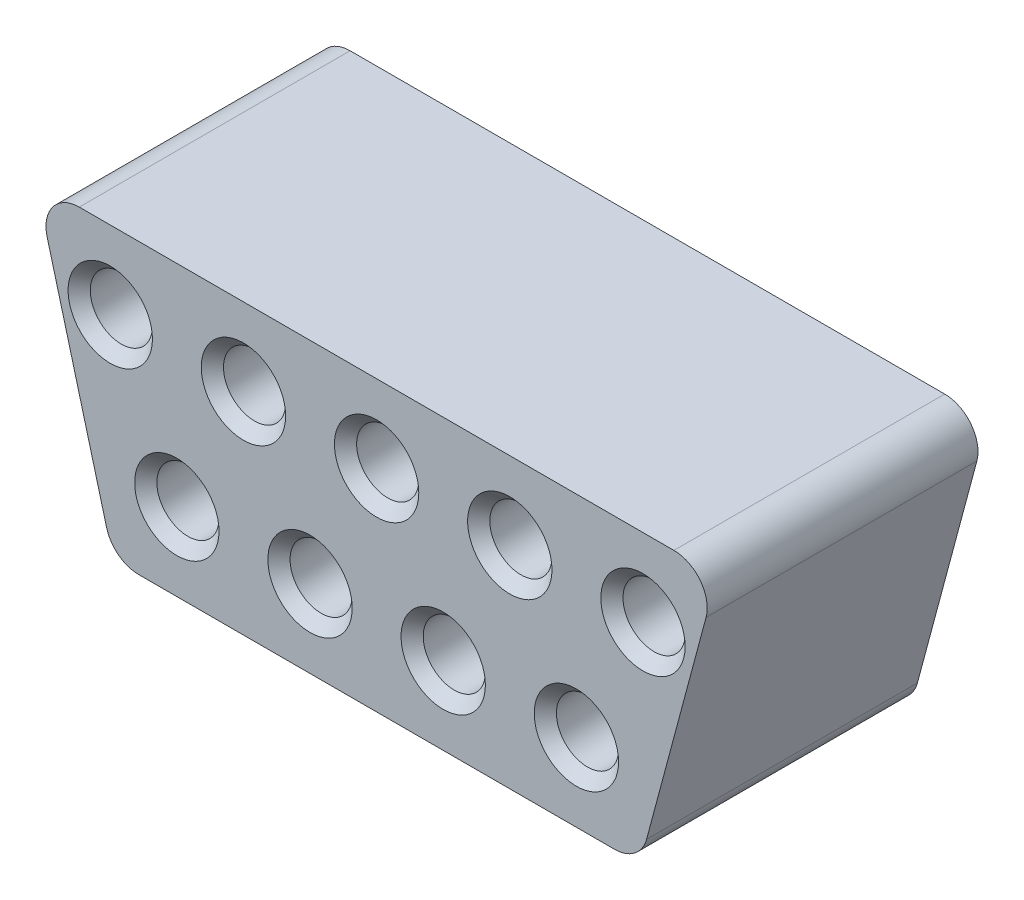
ISO-10303-21;
HEADER;
FILE_DESCRIPTION(('STEP AP214'),'2;1');
FILE_NAME('part.step','',(''),(''),'','','');
FILE_SCHEMA(('AUTOMOTIVE_DESIGN { 1 0 10303 214 1 1 1 1 }'));
ENDSEC;
DATA;
#1=APPLICATION_CONTEXT('core data for automotive mechanical design processes');
#2=APPLICATION_PROTOCOL_DEFINITION('international standard','automotive_design',2000,#1);
#3=PRODUCT_CONTEXT('',#1,'mechanical');
#4=PRODUCT('Part','Part','',(#3));
#5=PRODUCT_RELATED_PRODUCT_CATEGORY('part','',(#4));
#6=PRODUCT_DEFINITION_FORMATION('','',#4);
#7=PRODUCT_DEFINITION_CONTEXT('part definition',#1,'design');
#8=PRODUCT_DEFINITION('design','',#6,#7);
#9=PRODUCT_DEFINITION_SHAPE('','',#8);
#10=(LENGTH_UNIT() NAMED_UNIT(*) SI_UNIT(.MILLI.,.METRE.));
#11=(NAMED_UNIT(*) PLANE_ANGLE_UNIT() SI_UNIT($,.RADIAN.));
#12=(NAMED_UNIT(*) SI_UNIT($,.STERADIAN.) SOLID_ANGLE_UNIT());
#13=UNCERTAINTY_MEASURE_WITH_UNIT(LENGTH_MEASURE(1.E-05),#10,'distance_accuracy_value','');
#14=(GEOMETRIC_REPRESENTATION_CONTEXT(3) GLOBAL_UNCERTAINTY_ASSIGNED_CONTEXT((#13)) GLOBAL_UNIT_ASSIGNED_CONTEXT((#10,
#11,#12)) REPRESENTATION_CONTEXT('',''));
#15=CARTESIAN_POINT('',(0.,0.,0.));
#16=DIRECTION('',(0.,0.,1.));
#17=DIRECTION('',(1.,0.,0.));
#18=AXIS2_PLACEMENT_3D('',#15,#16,#17);
#19=CARTESIAN_POINT('',(-6.34791042089401,-1.70091747090367,6.1));
#20=DIRECTION('',(0.965925826289068,0.258819045102522,0.));
#21=DIRECTION('',(-0.258819045102522,0.965925826289068,0.));
#22=AXIS2_PLACEMENT_3D('',#19,#20,#21);
#23=PLANE('',#22);
#24=DIRECTION('',(0.258819045102522,-0.965925826289068,0.));
#25=VECTOR('',#24,1.);
#26=CARTESIAN_POINT('',(-6.34791042089401,-1.70091747090367,0.));
#27=LINE('',#26,#25);
#28=CARTESIAN_POINT('',(-7.42153009910168,2.3058857161731,0.));
#29=VERTEX_POINT('',#28);
#30=CARTESIAN_POINT('',(-6.08178413694606,-2.69411428382689,0.));
#31=VERTEX_POINT('',#30);
#32=EDGE_CURVE('E132',#29,#31,#27,.T.);
#33=ORIENTED_EDGE('',*,*,#32,.T.);
#34=DIRECTION('',(0.,0.,-1.));
#35=VECTOR('',#34,1.);
#36=CARTESIAN_POINT('',(-6.08178413694606,-2.69411428382689,6.1));
#37=LINE('',#36,#35);
#38=CARTESIAN_POINT('',(-6.08178413694606,-2.69411428382689,6.1));
#39=VERTEX_POINT('',#38);
#40=EDGE_CURVE('E163',#39,#31,#37,.T.);
#41=ORIENTED_EDGE('',*,*,#40,.F.);
#42=DIRECTION('',(0.258819045102522,-0.965925826289068,0.));
#43=VECTOR('',#42,1.);
#44=CARTESIAN_POINT('',(-6.34791042089401,-1.70091747090367,6.1));
#45=LINE('',#44,#43);
#46=CARTESIAN_POINT('',(-7.42153009910168,2.3058857161731,6.1));
#47=VERTEX_POINT('',#46);
#48=EDGE_CURVE('E151',#47,#39,#45,.T.);
#49=ORIENTED_EDGE('',*,*,#48,.F.);
#50=DIRECTION('',(0.,0.,-1.));
#51=VECTOR('',#50,1.);
#52=CARTESIAN_POINT('',(-7.42153009910168,2.3058857161731,6.1));
#53=LINE('',#52,#51);
#54=EDGE_CURVE('E51',#47,#29,#53,.T.);
#55=ORIENTED_EDGE('',*,*,#54,.T.);
#56=EDGE_LOOP('',(#33,#41,#49,#55));
#57=FACE_BOUND('',#56,.T.);
#58=ADVANCED_FACE('F34',(#57),#23,.F.);
#59=CARTESIAN_POINT('',(-5.35733976722926,-2.5,6.1));
#60=DIRECTION('',(0.,0.,-1.));
#61=DIRECTION('',(-1.,0.,0.));
#62=AXIS2_PLACEMENT_3D('',#59,#60,#61);
#63=CYLINDRICAL_SURFACE('',#62,0.75);
#64=CARTESIAN_POINT('',(-5.35733976722926,-2.5,0.));
#65=DIRECTION('',(0.,0.,1.));
#66=DIRECTION('',(1.,0.,0.));
#67=AXIS2_PLACEMENT_3D('',#64,#65,#66);
#68=CIRCLE('',#67,0.75);
#69=CARTESIAN_POINT('',(-5.35733976722925,-3.25,0.));
#70=VERTEX_POINT('',#69);
#71=EDGE_CURVE('E134',#31,#70,#68,.T.);
#72=ORIENTED_EDGE('',*,*,#71,.T.);
#73=DIRECTION('',(0.,0.,-1.));
#74=VECTOR('',#73,1.);
#75=CARTESIAN_POINT('',(-5.35733976722925,-3.25,6.1));
#76=LINE('',#75,#74);
#77=CARTESIAN_POINT('',(-5.35733976722925,-3.25,6.1));
#78=VERTEX_POINT('',#77);
#79=EDGE_CURVE('E160',#78,#70,#76,.T.);
#80=ORIENTED_EDGE('',*,*,#79,.F.);
#81=CARTESIAN_POINT('',(-5.35733976722926,-2.5,6.1));
#82=DIRECTION('',(0.,0.,1.));
#83=DIRECTION('',(1.,0.,0.));
#84=AXIS2_PLACEMENT_3D('',#81,#82,#83);
#85=CIRCLE('',#84,0.75);
#86=EDGE_CURVE('E90',#39,#78,#85,.T.);
#87=ORIENTED_EDGE('',*,*,#86,.F.);
#88=ORIENTED_EDGE('',*,*,#40,.T.);
#89=EDGE_LOOP('',(#72,#80,#87,#88));
#90=FACE_BOUND('',#89,.T.);
#91=ADVANCED_FACE('F232',(#90),#63,.T.);
#92=CARTESIAN_POINT('',(0.,-3.25,6.1));
#93=DIRECTION('',(0.,1.,0.));
#94=DIRECTION('',(0.,0.,1.));
#95=AXIS2_PLACEMENT_3D('',#92,#93,#94);
#96=PLANE('',#95);
#97=DIRECTION('',(1.,0.,0.));
#98=VECTOR('',#97,1.);
#99=CARTESIAN_POINT('',(0.,-3.25,0.));
#100=LINE('',#99,#98);
#101=CARTESIAN_POINT('',(5.35733976722925,-3.25,0.));
#102=VERTEX_POINT('',#101);
#103=EDGE_CURVE('E137',#70,#102,#100,.T.);
#104=ORIENTED_EDGE('',*,*,#103,.T.);
#105=DIRECTION('',(0.,0.,-1.));
#106=VECTOR('',#105,1.);
#107=CARTESIAN_POINT('',(5.35733976722925,-3.25,6.1));
#108=LINE('',#107,#106);
#109=CARTESIAN_POINT('',(5.35733976722925,-3.25,6.1));
#110=VERTEX_POINT('',#109);
#111=EDGE_CURVE('E157',#110,#102,#108,.T.);
#112=ORIENTED_EDGE('',*,*,#111,.F.);
#113=DIRECTION('',(1.,0.,0.));
#114=VECTOR('',#113,1.);
#115=CARTESIAN_POINT('',(0.,-3.25,6.1));
#116=LINE('',#115,#114);
#117=EDGE_CURVE('E297',#78,#110,#116,.T.);
#118=ORIENTED_EDGE('',*,*,#117,.F.);
#119=ORIENTED_EDGE('',*,*,#79,.T.);
#120=EDGE_LOOP('',(#104,#112,#118,#119));
#121=FACE_BOUND('',#120,.T.);
#122=ADVANCED_FACE('F237',(#121),#96,.F.);
#123=CARTESIAN_POINT('',(5.35733976722926,-2.5,6.1));
#124=DIRECTION('',(0.,0.,-1.));
#125=DIRECTION('',(-1.,0.,0.));
#126=AXIS2_PLACEMENT_3D('',#123,#124,#125);
#127=CYLINDRICAL_SURFACE('',#126,0.75);
#128=CARTESIAN_POINT('',(5.35733976722926,-2.5,0.));
#129=DIRECTION('',(0.,0.,1.));
#130=DIRECTION('',(1.,0.,0.));
#131=AXIS2_PLACEMENT_3D('',#128,#129,#130);
#132=CIRCLE('',#131,0.75);
#133=CARTESIAN_POINT('',(6.08178413694606,-2.69411428382689,0.));
#134=VERTEX_POINT('',#133);
#135=EDGE_CURVE('E139',#102,#134,#132,.T.);
#136=ORIENTED_EDGE('',*,*,#135,.T.);
#137=DIRECTION('',(0.,0.,-1.));
#138=VECTOR('',#137,1.);
#139=CARTESIAN_POINT('',(6.08178413694606,-2.69411428382689,6.1));
#140=LINE('',#139,#138);
#141=CARTESIAN_POINT('',(6.08178413694606,-2.69411428382689,6.1));
#142=VERTEX_POINT('',#141);
#143=EDGE_CURVE('E155',#142,#134,#140,.T.);
#144=ORIENTED_EDGE('',*,*,#143,.F.);
#145=CARTESIAN_POINT('',(5.35733976722926,-2.5,6.1));
#146=DIRECTION('',(0.,0.,1.));
#147=DIRECTION('',(1.,0.,0.));
#148=AXIS2_PLACEMENT_3D('',#145,#146,#147);
#149=CIRCLE('',#148,0.75);
#150=EDGE_CURVE('E299',#110,#142,#149,.T.);
#151=ORIENTED_EDGE('',*,*,#150,.F.);
#152=ORIENTED_EDGE('',*,*,#111,.T.);
#153=EDGE_LOOP('',(#136,#144,#151,#152));
#154=FACE_BOUND('',#153,.T.);
#155=ADVANCED_FACE('F323',(#154),#127,.T.);
#156=CARTESIAN_POINT('',(6.34791042089401,-1.70091747090367,6.1));
#157=DIRECTION('',(0.965925826289068,-0.258819045102522,0.));
#158=DIRECTION('',(0.258819045102522,0.965925826289068,0.));
#159=AXIS2_PLACEMENT_3D('',#156,#157,#158);
#160=PLANE('',#159);
#161=DIRECTION('',(-0.258819045102522,-0.965925826289068,0.));
#162=VECTOR('',#161,1.);
#163=CARTESIAN_POINT('',(6.34791042089401,-1.70091747090367,0.));
#164=LINE('',#163,#162);
#165=CARTESIAN_POINT('',(7.42153009910168,2.3058857161731,0.));
#166=VERTEX_POINT('',#165);
#167=EDGE_CURVE('E142',#166,#134,#164,.T.);
#168=ORIENTED_EDGE('',*,*,#167,.F.);
#169=DIRECTION('',(0.,0.,-1.));
#170=VECTOR('',#169,1.);
#171=CARTESIAN_POINT('',(7.42153009910168,2.3058857161731,6.1));
#172=LINE('',#171,#170);
#173=CARTESIAN_POINT('',(7.42153009910168,2.3058857161731,6.1));
#174=VERTEX_POINT('',#173);
#175=EDGE_CURVE('E124',#174,#166,#172,.T.);
#176=ORIENTED_EDGE('',*,*,#175,.F.);
#177=DIRECTION('',(-0.258819045102522,-0.965925826289068,0.));
#178=VECTOR('',#177,1.);
#179=CARTESIAN_POINT('',(6.34791042089401,-1.70091747090367,6.1));
#180=LINE('',#179,#178);
#181=EDGE_CURVE('E114',#174,#142,#180,.T.);
#182=ORIENTED_EDGE('',*,*,#181,.T.);
#183=ORIENTED_EDGE('',*,*,#143,.T.);
#184=EDGE_LOOP('',(#168,#176,#182,#183));
#185=FACE_BOUND('',#184,.T.);
#186=ADVANCED_FACE('F302',(#185),#160,.T.);
#187=CARTESIAN_POINT('',(6.69708572938488,2.5,6.1));
#188=DIRECTION('',(0.,0.,-1.));
#189=DIRECTION('',(-1.,0.,0.));
#190=AXIS2_PLACEMENT_3D('',#187,#188,#189);
#191=CYLINDRICAL_SURFACE('',#190,0.75);
#192=CARTESIAN_POINT('',(6.69708572938488,2.5,0.));
#193=DIRECTION('',(0.,0.,1.));
#194=DIRECTION('',(1.,0.,0.));
#195=AXIS2_PLACEMENT_3D('',#192,#193,#194);
#196=CIRCLE('',#195,0.75);
#197=CARTESIAN_POINT('',(6.69708572938487,3.25,0.));
#198=VERTEX_POINT('',#197);
#199=EDGE_CURVE('E121',#166,#198,#196,.T.);
#200=ORIENTED_EDGE('',*,*,#199,.T.);
#201=DIRECTION('',(0.,0.,-1.));
#202=VECTOR('',#201,1.);
#203=CARTESIAN_POINT('',(6.69708572938487,3.25,6.1));
#204=LINE('',#203,#202);
#205=CARTESIAN_POINT('',(6.69708572938487,3.25,6.1));
#206=VERTEX_POINT('',#205);
#207=EDGE_CURVE('E118',#206,#198,#204,.T.);
#208=ORIENTED_EDGE('',*,*,#207,.F.);
#209=CARTESIAN_POINT('',(6.69708572938488,2.5,6.1));
#210=DIRECTION('',(0.,0.,1.));
#211=DIRECTION('',(1.,0.,0.));
#212=AXIS2_PLACEMENT_3D('',#209,#210,#211);
#213=CIRCLE('',#212,0.75);
#214=EDGE_CURVE('E107',#174,#206,#213,.T.);
#215=ORIENTED_EDGE('',*,*,#214,.F.);
#216=ORIENTED_EDGE('',*,*,#175,.T.);
#217=EDGE_LOOP('',(#200,#208,#215,#216));
#218=FACE_BOUND('',#217,.T.);
#219=ADVANCED_FACE('F119',(#218),#191,.T.);
#220=CARTESIAN_POINT('',(0.,3.25,6.1));
#221=DIRECTION('',(0.,1.,0.));
#222=DIRECTION('',(0.,0.,1.));
#223=AXIS2_PLACEMENT_3D('',#220,#221,#222);
#224=PLANE('',#223);
#225=DIRECTION('',(1.,0.,0.));
#226=VECTOR('',#225,1.);
#227=CARTESIAN_POINT('',(0.,3.25,0.));
#228=LINE('',#227,#226);
#229=CARTESIAN_POINT('',(-6.69708572938487,3.25,0.));
#230=VERTEX_POINT('',#229);
#231=EDGE_CURVE('E146',#230,#198,#228,.T.);
#232=ORIENTED_EDGE('',*,*,#231,.F.);
#233=DIRECTION('',(0.,0.,-1.));
#234=VECTOR('',#233,1.);
#235=CARTESIAN_POINT('',(-6.69708572938487,3.25,6.1));
#236=LINE('',#235,#234);
#237=CARTESIAN_POINT('',(-6.69708572938487,3.25,6.1));
#238=VERTEX_POINT('',#237);
#239=EDGE_CURVE('E77',#238,#230,#236,.T.);
#240=ORIENTED_EDGE('',*,*,#239,.F.);
#241=DIRECTION('',(1.,0.,0.));
#242=VECTOR('',#241,1.);
#243=CARTESIAN_POINT('',(0.,3.25,6.1));
#244=LINE('',#243,#242);
#245=EDGE_CURVE('E112',#238,#206,#244,.T.);
#246=ORIENTED_EDGE('',*,*,#245,.T.);
#247=ORIENTED_EDGE('',*,*,#207,.T.);
#248=EDGE_LOOP('',(#232,#240,#246,#247));
#249=FACE_BOUND('',#248,.T.);
#250=ADVANCED_FACE('F126',(#249),#224,.T.);
#251=CARTESIAN_POINT('',(-6.69708572938488,2.5,6.1));
#252=DIRECTION('',(0.,0.,-1.));
#253=DIRECTION('',(-1.,0.,0.));
#254=AXIS2_PLACEMENT_3D('',#251,#252,#253);
#255=CYLINDRICAL_SURFACE('',#254,0.75);
#256=CARTESIAN_POINT('',(-6.69708572938488,2.5,0.));
#257=DIRECTION('',(0.,0.,1.));
#258=DIRECTION('',(1.,0.,0.));
#259=AXIS2_PLACEMENT_3D('',#256,#257,#258);
#260=CIRCLE('',#259,0.75);
#261=EDGE_CURVE('E148',#29,#230,#260,.F.);
#262=ORIENTED_EDGE('',*,*,#261,.F.);
#263=ORIENTED_EDGE('',*,*,#54,.F.);
#264=CARTESIAN_POINT('',(-6.69708572938488,2.5,6.1));
#265=DIRECTION('',(0.,0.,1.));
#266=DIRECTION('',(1.,0.,0.));
#267=AXIS2_PLACEMENT_3D('',#264,#265,#266);
#268=CIRCLE('',#267,0.75);
#269=EDGE_CURVE('E127',#47,#238,#268,.F.);
#270=ORIENTED_EDGE('',*,*,#269,.T.);
#271=ORIENTED_EDGE('',*,*,#239,.T.);
#272=EDGE_LOOP('',(#262,#263,#270,#271));
#273=FACE_BOUND('',#272,.T.);
#274=ADVANCED_FACE('F307',(#273),#255,.T.);
#275=CARTESIAN_POINT('',(0.,0.,6.1));
#276=DIRECTION('',(0.,0.,1.));
#277=DIRECTION('',(1.,0.,0.));
#278=AXIS2_PLACEMENT_3D('',#275,#276,#277);
#279=PLANE('',#278);
#280=CARTESIAN_POINT('',(-4.49949692208357,-1.5,6.1));
#281=DIRECTION('',(0.,0.,1.));
#282=DIRECTION('',(1.,0.,0.));
#283=AXIS2_PLACEMENT_3D('',#280,#281,#282);
#284=CIRCLE('',#283,0.950000000000005);
#285=CARTESIAN_POINT('',(-3.54949692208357,-1.5,6.1));
#286=VERTEX_POINT('',#285);
#287=EDGE_CURVE('E192',#286,#286,#284,.F.);
#288=ORIENTED_EDGE('',*,*,#287,.T.);
#289=EDGE_LOOP('',(#288));
#290=FACE_BOUND('',#289,.T.);
#291=CARTESIAN_POINT('',(-1.49949692208357,-1.5,6.1));
#292=DIRECTION('',(0.,0.,1.));
#293=DIRECTION('',(1.,0.,0.));
#294=AXIS2_PLACEMENT_3D('',#291,#292,#293);
#295=CIRCLE('',#294,0.950000000000005);
#296=CARTESIAN_POINT('',(-0.549496922083567,-1.5,6.1));
#297=VERTEX_POINT('',#296);
#298=EDGE_CURVE('E189',#297,#297,#295,.F.);
#299=ORIENTED_EDGE('',*,*,#298,.T.);
#300=EDGE_LOOP('',(#299));
#301=FACE_BOUND('',#300,.T.);
#302=CARTESIAN_POINT('',(1.50050307791643,-1.5,6.1));
#303=DIRECTION('',(0.,0.,1.));
#304=DIRECTION('',(1.,0.,0.));
#305=AXIS2_PLACEMENT_3D('',#302,#303,#304);
#306=CIRCLE('',#305,0.950000000000005);
#307=CARTESIAN_POINT('',(2.45050307791643,-1.5,6.1));
#308=VERTEX_POINT('',#307);
#309=EDGE_CURVE('E186',#308,#308,#306,.F.);
#310=ORIENTED_EDGE('',*,*,#309,.T.);
#311=EDGE_LOOP('',(#310));
#312=FACE_BOUND('',#311,.T.);
#313=CARTESIAN_POINT('',(4.50050307791643,-1.5,6.1));
#314=DIRECTION('',(0.,0.,1.));
#315=DIRECTION('',(1.,0.,0.));
#316=AXIS2_PLACEMENT_3D('',#313,#314,#315);
#317=CIRCLE('',#316,0.950000000000005);
#318=CARTESIAN_POINT('',(5.45050307791643,-1.5,6.1));
#319=VERTEX_POINT('',#318);
#320=EDGE_CURVE('E183',#319,#319,#317,.F.);
#321=ORIENTED_EDGE('',*,*,#320,.T.);
#322=EDGE_LOOP('',(#321));
#323=FACE_BOUND('',#322,.T.);
#324=CARTESIAN_POINT('',(6.00050307791643,1.5,6.1));
#325=DIRECTION('',(0.,0.,1.));
#326=DIRECTION('',(1.,0.,0.));
#327=AXIS2_PLACEMENT_3D('',#324,#325,#326);
#328=CIRCLE('',#327,0.95);
#329=CARTESIAN_POINT('',(6.95050307791643,1.5,6.1));
#330=VERTEX_POINT('',#329);
#331=EDGE_CURVE('E180',#330,#330,#328,.F.);
#332=ORIENTED_EDGE('',*,*,#331,.T.);
#333=EDGE_LOOP('',(#332));
#334=FACE_BOUND('',#333,.T.);
#335=CARTESIAN_POINT('',(3.00050307791643,1.5,6.1));
#336=DIRECTION('',(0.,0.,1.));
#337=DIRECTION('',(1.,0.,0.));
#338=AXIS2_PLACEMENT_3D('',#335,#336,#337);
#339=CIRCLE('',#338,0.950000000000005);
#340=CARTESIAN_POINT('',(3.95050307791643,1.5,6.1));
#341=VERTEX_POINT('',#340);
#342=EDGE_CURVE('E177',#341,#341,#339,.F.);
#343=ORIENTED_EDGE('',*,*,#342,.T.);
#344=EDGE_LOOP('',(#343));
#345=FACE_BOUND('',#344,.T.);
#346=CARTESIAN_POINT('',(0.000503077916427438,1.5,6.1));
#347=DIRECTION('',(0.,0.,1.));
#348=DIRECTION('',(1.,0.,0.));
#349=AXIS2_PLACEMENT_3D('',#346,#347,#348);
#350=CIRCLE('',#349,0.949999999999999);
#351=CARTESIAN_POINT('',(0.950503077916427,1.5,6.1));
#352=VERTEX_POINT('',#351);
#353=EDGE_CURVE('E174',#352,#352,#350,.F.);
#354=ORIENTED_EDGE('',*,*,#353,.T.);
#355=EDGE_LOOP('',(#354));
#356=FACE_BOUND('',#355,.T.);
#357=CARTESIAN_POINT('',(-2.99949692208357,1.5,6.1));
#358=DIRECTION('',(0.,0.,1.));
#359=DIRECTION('',(1.,0.,0.));
#360=AXIS2_PLACEMENT_3D('',#357,#358,#359);
#361=CIRCLE('',#360,0.950000000000005);
#362=CARTESIAN_POINT('',(-2.04949692208357,1.5,6.1));
#363=VERTEX_POINT('',#362);
#364=EDGE_CURVE('E171',#363,#363,#361,.F.);
#365=ORIENTED_EDGE('',*,*,#364,.T.);
#366=EDGE_LOOP('',(#365));
#367=FACE_BOUND('',#366,.T.);
#368=CARTESIAN_POINT('',(-5.99949692208357,1.5,6.1));
#369=DIRECTION('',(0.,0.,1.));
#370=DIRECTION('',(1.,0.,0.));
#371=AXIS2_PLACEMENT_3D('',#368,#369,#370);
#372=CIRCLE('',#371,0.949999999999996);
#373=CARTESIAN_POINT('',(-5.04949692208358,1.5,6.1));
#374=VERTEX_POINT('',#373);
#375=EDGE_CURVE('E168',#374,#374,#372,.F.);
#376=ORIENTED_EDGE('',*,*,#375,.T.);
#377=EDGE_LOOP('',(#376));
#378=FACE_BOUND('',#377,.T.);
#379=ORIENTED_EDGE('',*,*,#48,.T.);
#380=ORIENTED_EDGE('',*,*,#86,.T.);
#381=ORIENTED_EDGE('',*,*,#117,.T.);
#382=ORIENTED_EDGE('',*,*,#150,.T.);
#383=ORIENTED_EDGE('',*,*,#181,.F.);
#384=ORIENTED_EDGE('',*,*,#214,.T.);
#385=ORIENTED_EDGE('',*,*,#245,.F.);
#386=ORIENTED_EDGE('',*,*,#269,.F.);
#387=EDGE_LOOP('',(#379,#380,#381,#382,#383,#384,#385,#386));
#388=FACE_BOUND('',#387,.T.);
#389=ADVANCED_FACE('F109',(#290,#301,#312,#323,#334,#345,#356,#367,#378,#388),#279,.T.);
#390=CARTESIAN_POINT('',(0.,0.,0.));
#391=DIRECTION('',(0.,0.,1.));
#392=DIRECTION('',(1.,0.,0.));
#393=AXIS2_PLACEMENT_3D('',#390,#391,#392);
#394=PLANE('',#393);
#395=CARTESIAN_POINT('',(4.50050307791643,-1.5,0.));
#396=DIRECTION('',(0.,0.,1.));
#397=DIRECTION('',(1.,0.,0.));
#398=AXIS2_PLACEMENT_3D('',#395,#396,#397);
#399=CIRCLE('',#398,0.700000000000001);
#400=CARTESIAN_POINT('',(5.20050307791643,-1.5,0.));
#401=VERTEX_POINT('',#400);
#402=EDGE_CURVE('E510',#401,#401,#399,.F.);
#403=ORIENTED_EDGE('',*,*,#402,.F.);
#404=EDGE_LOOP('',(#403));
#405=FACE_BOUND('',#404,.T.);
#406=CARTESIAN_POINT('',(1.50050307791643,-1.5,0.));
#407=DIRECTION('',(0.,0.,1.));
#408=DIRECTION('',(1.,0.,0.));
#409=AXIS2_PLACEMENT_3D('',#406,#407,#408);
#410=CIRCLE('',#409,0.7);
#411=CARTESIAN_POINT('',(2.20050307791643,-1.5,0.));
#412=VERTEX_POINT('',#411);
#413=EDGE_CURVE('E511',#412,#412,#410,.F.);
#414=ORIENTED_EDGE('',*,*,#413,.F.);
#415=EDGE_LOOP('',(#414));
#416=FACE_BOUND('',#415,.T.);
#417=CARTESIAN_POINT('',(-1.49949692208357,-1.5,0.));
#418=DIRECTION('',(0.,0.,1.));
#419=DIRECTION('',(1.,0.,0.));
#420=AXIS2_PLACEMENT_3D('',#417,#418,#419);
#421=CIRCLE('',#420,0.7);
#422=CARTESIAN_POINT('',(-0.799496922083572,-1.5,0.));
#423=VERTEX_POINT('',#422);
#424=EDGE_CURVE('E514',#423,#423,#421,.F.);
#425=ORIENTED_EDGE('',*,*,#424,.F.);
#426=EDGE_LOOP('',(#425));
#427=FACE_BOUND('',#426,.T.);
#428=CARTESIAN_POINT('',(-4.49949692208357,-1.5,0.));
#429=DIRECTION('',(0.,0.,1.));
#430=DIRECTION('',(1.,0.,0.));
#431=AXIS2_PLACEMENT_3D('',#428,#429,#430);
#432=CIRCLE('',#431,0.7);
#433=CARTESIAN_POINT('',(-3.79949692208357,-1.5,0.));
#434=VERTEX_POINT('',#433);
#435=EDGE_CURVE('E287',#434,#434,#432,.F.);
#436=ORIENTED_EDGE('',*,*,#435,.F.);
#437=EDGE_LOOP('',(#436));
#438=FACE_BOUND('',#437,.T.);
#439=CARTESIAN_POINT('',(6.00050307791643,1.5,0.));
#440=DIRECTION('',(0.,0.,1.));
#441=DIRECTION('',(1.,0.,0.));
#442=AXIS2_PLACEMENT_3D('',#439,#440,#441);
#443=CIRCLE('',#442,0.7);
#444=CARTESIAN_POINT('',(6.70050307791643,1.5,0.));
#445=VERTEX_POINT('',#444);
#446=EDGE_CURVE('E281',#445,#445,#443,.F.);
#447=ORIENTED_EDGE('',*,*,#446,.F.);
#448=EDGE_LOOP('',(#447));
#449=FACE_BOUND('',#448,.T.);
#450=CARTESIAN_POINT('',(3.00050307791643,1.5,0.));
#451=DIRECTION('',(0.,0.,1.));
#452=DIRECTION('',(1.,0.,0.));
#453=AXIS2_PLACEMENT_3D('',#450,#451,#452);
#454=CIRCLE('',#453,0.7);
#455=CARTESIAN_POINT('',(3.70050307791643,1.5,0.));
#456=VERTEX_POINT('',#455);
#457=EDGE_CURVE('E278',#456,#456,#454,.F.);
#458=ORIENTED_EDGE('',*,*,#457,.F.);
#459=EDGE_LOOP('',(#458));
#460=FACE_BOUND('',#459,.T.);
#461=CARTESIAN_POINT('',(0.000503077916427438,1.5,0.));
#462=DIRECTION('',(0.,0.,1.));
#463=DIRECTION('',(1.,0.,0.));
#464=AXIS2_PLACEMENT_3D('',#461,#462,#463);
#465=CIRCLE('',#464,0.7);
#466=CARTESIAN_POINT('',(0.700503077916427,1.5,0.));
#467=VERTEX_POINT('',#466);
#468=EDGE_CURVE('E280',#467,#467,#465,.F.);
#469=ORIENTED_EDGE('',*,*,#468,.F.);
#470=EDGE_LOOP('',(#469));
#471=FACE_BOUND('',#470,.T.);
#472=CARTESIAN_POINT('',(-2.99949692208357,1.5,0.));
#473=DIRECTION('',(0.,0.,1.));
#474=DIRECTION('',(1.,0.,0.));
#475=AXIS2_PLACEMENT_3D('',#472,#473,#474);
#476=CIRCLE('',#475,0.7);
#477=CARTESIAN_POINT('',(-2.29949692208357,1.5,0.));
#478=VERTEX_POINT('',#477);
#479=EDGE_CURVE('E284',#478,#478,#476,.F.);
#480=ORIENTED_EDGE('',*,*,#479,.F.);
#481=EDGE_LOOP('',(#480));
#482=FACE_BOUND('',#481,.T.);
#483=CARTESIAN_POINT('',(-5.99949692208357,1.5,0.));
#484=DIRECTION('',(0.,0.,1.));
#485=DIRECTION('',(1.,0.,0.));
#486=AXIS2_PLACEMENT_3D('',#483,#484,#485);
#487=CIRCLE('',#486,0.7);
#488=CARTESIAN_POINT('',(-5.29949692208357,1.5,0.));
#489=VERTEX_POINT('',#488);
#490=EDGE_CURVE('E135',#489,#489,#487,.F.);
#491=ORIENTED_EDGE('',*,*,#490,.F.);
#492=EDGE_LOOP('',(#491));
#493=FACE_BOUND('',#492,.T.);
#494=ORIENTED_EDGE('',*,*,#32,.F.);
#495=ORIENTED_EDGE('',*,*,#261,.T.);
#496=ORIENTED_EDGE('',*,*,#231,.T.);
#497=ORIENTED_EDGE('',*,*,#199,.F.);
#498=ORIENTED_EDGE('',*,*,#167,.T.);
#499=ORIENTED_EDGE('',*,*,#135,.F.);
#500=ORIENTED_EDGE('',*,*,#103,.F.);
#501=ORIENTED_EDGE('',*,*,#71,.F.);
#502=EDGE_LOOP('',(#494,#495,#496,#497,#498,#499,#500,#501));
#503=FACE_BOUND('',#502,.T.);
#504=ADVANCED_FACE('F305',(#405,#416,#427,#438,#449,#460,#471,#482,#493,#503),#394,.F.);
#505=CARTESIAN_POINT('',(-5.99949692208357,1.5,-0.00100000000000013));
#506=DIRECTION('',(0.,0.,1.));
#507=DIRECTION('',(1.,0.,0.));
#508=AXIS2_PLACEMENT_3D('',#505,#506,#507);
#509=CYLINDRICAL_SURFACE('',#508,0.7);
#510=CARTESIAN_POINT('',(-5.99949692208357,1.5,5.85000000000001));
#511=DIRECTION('',(0.,0.,1.));
#512=DIRECTION('',(1.,0.,0.));
#513=AXIS2_PLACEMENT_3D('',#510,#511,#512);
#514=CIRCLE('',#513,0.7);
#515=CARTESIAN_POINT('',(-5.29949692208357,1.5,5.85000000000001));
#516=VERTEX_POINT('',#515);
#517=EDGE_CURVE('E11',#516,#516,#514,.T.);
#518=ORIENTED_EDGE('',*,*,#517,.T.);
#519=EDGE_LOOP('',(#518));
#520=FACE_BOUND('',#519,.T.);
#521=ORIENTED_EDGE('',*,*,#490,.T.);
#522=EDGE_LOOP('',(#521));
#523=FACE_BOUND('',#522,.T.);
#524=ADVANCED_FACE('F367',(#520,#523),#509,.F.);
#525=CARTESIAN_POINT('',(-2.99949692208357,1.5,-0.00100000000000013));
#526=DIRECTION('',(0.,0.,1.));
#527=DIRECTION('',(1.,0.,0.));
#528=AXIS2_PLACEMENT_3D('',#525,#526,#527);
#529=CYLINDRICAL_SURFACE('',#528,0.7);
#530=CARTESIAN_POINT('',(-2.99949692208357,1.5,5.85));
#531=DIRECTION('',(0.,0.,1.));
#532=DIRECTION('',(1.,0.,0.));
#533=AXIS2_PLACEMENT_3D('',#530,#531,#532);
#534=CIRCLE('',#533,0.7);
#535=CARTESIAN_POINT('',(-2.29949692208357,1.5,5.85));
#536=VERTEX_POINT('',#535);
#537=EDGE_CURVE('E43',#536,#536,#534,.T.);
#538=ORIENTED_EDGE('',*,*,#537,.T.);
#539=EDGE_LOOP('',(#538));
#540=FACE_BOUND('',#539,.T.);
#541=ORIENTED_EDGE('',*,*,#479,.T.);
#542=EDGE_LOOP('',(#541));
#543=FACE_BOUND('',#542,.T.);
#544=ADVANCED_FACE('F215',(#540,#543),#529,.F.);
#545=CARTESIAN_POINT('',(0.000503077916427438,1.5,-0.00100000000000013));
#546=DIRECTION('',(0.,0.,1.));
#547=DIRECTION('',(1.,0.,0.));
#548=AXIS2_PLACEMENT_3D('',#545,#546,#547);
#549=CYLINDRICAL_SURFACE('',#548,0.7);
#550=CARTESIAN_POINT('',(0.000503077916427438,1.5,5.85));
#551=DIRECTION('',(0.,0.,1.));
#552=DIRECTION('',(1.,0.,0.));
#553=AXIS2_PLACEMENT_3D('',#550,#551,#552);
#554=CIRCLE('',#553,0.7);
#555=CARTESIAN_POINT('',(0.700503077916427,1.5,5.85));
#556=VERTEX_POINT('',#555);
#557=EDGE_CURVE('E210',#556,#556,#554,.T.);
#558=ORIENTED_EDGE('',*,*,#557,.T.);
#559=EDGE_LOOP('',(#558));
#560=FACE_BOUND('',#559,.T.);
#561=ORIENTED_EDGE('',*,*,#468,.T.);
#562=EDGE_LOOP('',(#561));
#563=FACE_BOUND('',#562,.T.);
#564=ADVANCED_FACE('F274',(#560,#563),#549,.F.);
#565=CARTESIAN_POINT('',(3.00050307791643,1.5,-0.00100000000000013));
#566=DIRECTION('',(0.,0.,1.));
#567=DIRECTION('',(1.,0.,0.));
#568=AXIS2_PLACEMENT_3D('',#565,#566,#567);
#569=CYLINDRICAL_SURFACE('',#568,0.7);
#570=CARTESIAN_POINT('',(3.00050307791643,1.5,5.85));
#571=DIRECTION('',(0.,0.,1.));
#572=DIRECTION('',(1.,0.,0.));
#573=AXIS2_PLACEMENT_3D('',#570,#571,#572);
#574=CIRCLE('',#573,0.7);
#575=CARTESIAN_POINT('',(3.70050307791643,1.5,5.85));
#576=VERTEX_POINT('',#575);
#577=EDGE_CURVE('E207',#576,#576,#574,.T.);
#578=ORIENTED_EDGE('',*,*,#577,.T.);
#579=EDGE_LOOP('',(#578));
#580=FACE_BOUND('',#579,.T.);
#581=ORIENTED_EDGE('',*,*,#457,.T.);
#582=EDGE_LOOP('',(#581));
#583=FACE_BOUND('',#582,.T.);
#584=ADVANCED_FACE('F270',(#580,#583),#569,.F.);
#585=CARTESIAN_POINT('',(6.00050307791643,1.5,-0.00100000000000013));
#586=DIRECTION('',(0.,0.,1.));
#587=DIRECTION('',(1.,0.,0.));
#588=AXIS2_PLACEMENT_3D('',#585,#586,#587);
#589=CYLINDRICAL_SURFACE('',#588,0.7);
#590=CARTESIAN_POINT('',(6.00050307791643,1.5,5.85));
#591=DIRECTION('',(0.,0.,1.));
#592=DIRECTION('',(1.,0.,0.));
#593=AXIS2_PLACEMENT_3D('',#590,#591,#592);
#594=CIRCLE('',#593,0.7);
#595=CARTESIAN_POINT('',(6.70050307791643,1.5,5.85));
#596=VERTEX_POINT('',#595);
#597=EDGE_CURVE('E204',#596,#596,#594,.T.);
#598=ORIENTED_EDGE('',*,*,#597,.T.);
#599=EDGE_LOOP('',(#598));
#600=FACE_BOUND('',#599,.T.);
#601=ORIENTED_EDGE('',*,*,#446,.T.);
#602=EDGE_LOOP('',(#601));
#603=FACE_BOUND('',#602,.T.);
#604=ADVANCED_FACE('F273',(#600,#603),#589,.F.);
#605=CARTESIAN_POINT('',(-4.49949692208357,-1.5,-0.00100000000000013));
#606=DIRECTION('',(0.,0.,1.));
#607=DIRECTION('',(1.,0.,0.));
#608=AXIS2_PLACEMENT_3D('',#605,#606,#607);
#609=CYLINDRICAL_SURFACE('',#608,0.7);
#610=CARTESIAN_POINT('',(-4.49949692208357,-1.5,5.85));
#611=DIRECTION('',(0.,0.,1.));
#612=DIRECTION('',(1.,0.,0.));
#613=AXIS2_PLACEMENT_3D('',#610,#611,#612);
#614=CIRCLE('',#613,0.7);
#615=CARTESIAN_POINT('',(-3.79949692208357,-1.5,5.85));
#616=VERTEX_POINT('',#615);
#617=EDGE_CURVE('E165',#616,#616,#614,.T.);
#618=ORIENTED_EDGE('',*,*,#617,.T.);
#619=EDGE_LOOP('',(#618));
#620=FACE_BOUND('',#619,.T.);
#621=ORIENTED_EDGE('',*,*,#435,.T.);
#622=EDGE_LOOP('',(#621));
#623=FACE_BOUND('',#622,.T.);
#624=ADVANCED_FACE('F413',(#620,#623),#609,.F.);
#625=CARTESIAN_POINT('',(-1.49949692208357,-1.5,-0.00100000000000013));
#626=DIRECTION('',(0.,0.,1.));
#627=DIRECTION('',(1.,0.,0.));
#628=AXIS2_PLACEMENT_3D('',#625,#626,#627);
#629=CYLINDRICAL_SURFACE('',#628,0.7);
#630=CARTESIAN_POINT('',(-1.49949692208357,-1.5,5.85));
#631=DIRECTION('',(0.,0.,1.));
#632=DIRECTION('',(1.,0.,0.));
#633=AXIS2_PLACEMENT_3D('',#630,#631,#632);
#634=CIRCLE('',#633,0.7);
#635=CARTESIAN_POINT('',(-0.799496922083572,-1.5,5.85));
#636=VERTEX_POINT('',#635);
#637=EDGE_CURVE('E195',#636,#636,#634,.T.);
#638=ORIENTED_EDGE('',*,*,#637,.T.);
#639=EDGE_LOOP('',(#638));
#640=FACE_BOUND('',#639,.T.);
#641=ORIENTED_EDGE('',*,*,#424,.T.);
#642=EDGE_LOOP('',(#641));
#643=FACE_BOUND('',#642,.T.);
#644=ADVANCED_FACE('F423',(#640,#643),#629,.F.);
#645=CARTESIAN_POINT('',(1.50050307791643,-1.5,-0.00100000000000013));
#646=DIRECTION('',(0.,0.,1.));
#647=DIRECTION('',(1.,0.,0.));
#648=AXIS2_PLACEMENT_3D('',#645,#646,#647);
#649=CYLINDRICAL_SURFACE('',#648,0.7);
#650=CARTESIAN_POINT('',(1.50050307791643,-1.5,5.85));
#651=DIRECTION('',(0.,0.,1.));
#652=DIRECTION('',(1.,0.,0.));
#653=AXIS2_PLACEMENT_3D('',#650,#651,#652);
#654=CIRCLE('',#653,0.7);
#655=CARTESIAN_POINT('',(2.20050307791643,-1.5,5.85));
#656=VERTEX_POINT('',#655);
#657=EDGE_CURVE('E198',#656,#656,#654,.T.);
#658=ORIENTED_EDGE('',*,*,#657,.T.);
#659=EDGE_LOOP('',(#658));
#660=FACE_BOUND('',#659,.T.);
#661=ORIENTED_EDGE('',*,*,#413,.T.);
#662=EDGE_LOOP('',(#661));
#663=FACE_BOUND('',#662,.T.);
#664=ADVANCED_FACE('F433',(#660,#663),#649,.F.);
#665=CARTESIAN_POINT('',(4.50050307791643,-1.5,-0.00100000000000013));
#666=DIRECTION('',(0.,0.,1.));
#667=DIRECTION('',(1.,0.,0.));
#668=AXIS2_PLACEMENT_3D('',#665,#666,#667);
#669=CYLINDRICAL_SURFACE('',#668,0.700000000000001);
#670=CARTESIAN_POINT('',(4.50050307791643,-1.5,5.85));
#671=DIRECTION('',(0.,0.,1.));
#672=DIRECTION('',(1.,0.,0.));
#673=AXIS2_PLACEMENT_3D('',#670,#671,#672);
#674=CIRCLE('',#673,0.700000000000001);
#675=CARTESIAN_POINT('',(5.20050307791643,-1.5,5.85));
#676=VERTEX_POINT('',#675);
#677=EDGE_CURVE('E201',#676,#676,#674,.T.);
#678=ORIENTED_EDGE('',*,*,#677,.T.);
#679=EDGE_LOOP('',(#678));
#680=FACE_BOUND('',#679,.T.);
#681=ORIENTED_EDGE('',*,*,#402,.T.);
#682=EDGE_LOOP('',(#681));
#683=FACE_BOUND('',#682,.T.);
#684=ADVANCED_FACE('F245',(#680,#683),#669,.F.);
#685=CARTESIAN_POINT('',(-4.49949692208357,-1.5,5.85));
#686=DIRECTION('',(0.,0.,1.));
#687=DIRECTION('',(1.,0.,0.));
#688=AXIS2_PLACEMENT_3D('',#685,#686,#687);
#689=CONICAL_SURFACE('',#688,0.7,0.78539816339745);
#690=ORIENTED_EDGE('',*,*,#287,.F.);
#691=EDGE_LOOP('',(#690));
#692=FACE_BOUND('',#691,.T.);
#693=ORIENTED_EDGE('',*,*,#617,.F.);
#694=EDGE_LOOP('',(#693));
#695=FACE_BOUND('',#694,.T.);
#696=ADVANCED_FACE('F241',(#692,#695),#689,.F.);
#697=CARTESIAN_POINT('',(-1.49949692208357,-1.5,5.85));
#698=DIRECTION('',(0.,0.,1.));
#699=DIRECTION('',(1.,0.,0.));
#700=AXIS2_PLACEMENT_3D('',#697,#698,#699);
#701=CONICAL_SURFACE('',#700,0.7,0.78539816339745);
#702=ORIENTED_EDGE('',*,*,#298,.F.);
#703=EDGE_LOOP('',(#702));
#704=FACE_BOUND('',#703,.T.);
#705=ORIENTED_EDGE('',*,*,#637,.F.);
#706=EDGE_LOOP('',(#705));
#707=FACE_BOUND('',#706,.T.);
#708=ADVANCED_FACE('F244',(#704,#707),#701,.F.);
#709=CARTESIAN_POINT('',(1.50050307791643,-1.5,5.85));
#710=DIRECTION('',(0.,0.,1.));
#711=DIRECTION('',(1.,0.,0.));
#712=AXIS2_PLACEMENT_3D('',#709,#710,#711);
#713=CONICAL_SURFACE('',#712,0.7,0.78539816339745);
#714=ORIENTED_EDGE('',*,*,#309,.F.);
#715=EDGE_LOOP('',(#714));
#716=FACE_BOUND('',#715,.T.);
#717=ORIENTED_EDGE('',*,*,#657,.F.);
#718=EDGE_LOOP('',(#717));
#719=FACE_BOUND('',#718,.T.);
#720=ADVANCED_FACE('F249',(#716,#719),#713,.F.);
#721=CARTESIAN_POINT('',(4.50050307791643,-1.5,5.85));
#722=DIRECTION('',(0.,0.,1.));
#723=DIRECTION('',(1.,0.,0.));
#724=AXIS2_PLACEMENT_3D('',#721,#722,#723);
#725=CONICAL_SURFACE('',#724,0.700000000000001,0.785398163397451);
#726=ORIENTED_EDGE('',*,*,#320,.F.);
#727=EDGE_LOOP('',(#726));
#728=FACE_BOUND('',#727,.T.);
#729=ORIENTED_EDGE('',*,*,#677,.F.);
#730=EDGE_LOOP('',(#729));
#731=FACE_BOUND('',#730,.T.);
#732=ADVANCED_FACE('F253',(#728,#731),#725,.F.);
#733=CARTESIAN_POINT('',(6.00050307791643,1.5,5.85));
#734=DIRECTION('',(0.,0.,1.));
#735=DIRECTION('',(1.,0.,0.));
#736=AXIS2_PLACEMENT_3D('',#733,#734,#735);
#737=CONICAL_SURFACE('',#736,0.7,0.785398163397451);
#738=ORIENTED_EDGE('',*,*,#331,.F.);
#739=EDGE_LOOP('',(#738));
#740=FACE_BOUND('',#739,.T.);
#741=ORIENTED_EDGE('',*,*,#597,.F.);
#742=EDGE_LOOP('',(#741));
#743=FACE_BOUND('',#742,.T.);
#744=ADVANCED_FACE('F257',(#740,#743),#737,.F.);
#745=CARTESIAN_POINT('',(3.00050307791643,1.5,5.85));
#746=DIRECTION('',(0.,0.,1.));
#747=DIRECTION('',(1.,0.,0.));
#748=AXIS2_PLACEMENT_3D('',#745,#746,#747);
#749=CONICAL_SURFACE('',#748,0.7,0.78539816339745);
#750=ORIENTED_EDGE('',*,*,#342,.F.);
#751=EDGE_LOOP('',(#750));
#752=FACE_BOUND('',#751,.T.);
#753=ORIENTED_EDGE('',*,*,#577,.F.);
#754=EDGE_LOOP('',(#753));
#755=FACE_BOUND('',#754,.T.);
#756=ADVANCED_FACE('F227',(#752,#755),#749,.F.);
#757=CARTESIAN_POINT('',(0.000503077916427438,1.5,5.85));
#758=DIRECTION('',(0.,0.,1.));
#759=DIRECTION('',(1.,0.,0.));
#760=AXIS2_PLACEMENT_3D('',#757,#758,#759);
#761=CONICAL_SURFACE('',#760,0.7,0.78539816339745);
#762=ORIENTED_EDGE('',*,*,#353,.F.);
#763=EDGE_LOOP('',(#762));
#764=FACE_BOUND('',#763,.T.);
#765=ORIENTED_EDGE('',*,*,#557,.F.);
#766=EDGE_LOOP('',(#765));
#767=FACE_BOUND('',#766,.T.);
#768=ADVANCED_FACE('F220',(#764,#767),#761,.F.);
#769=CARTESIAN_POINT('',(-2.99949692208357,1.5,5.85));
#770=DIRECTION('',(0.,0.,1.));
#771=DIRECTION('',(1.,0.,0.));
#772=AXIS2_PLACEMENT_3D('',#769,#770,#771);
#773=CONICAL_SURFACE('',#772,0.7,0.78539816339745);
#774=ORIENTED_EDGE('',*,*,#364,.F.);
#775=EDGE_LOOP('',(#774));
#776=FACE_BOUND('',#775,.T.);
#777=ORIENTED_EDGE('',*,*,#537,.F.);
#778=EDGE_LOOP('',(#777));
#779=FACE_BOUND('',#778,.T.);
#780=ADVANCED_FACE('F218',(#776,#779),#773,.F.);
#781=CARTESIAN_POINT('',(-5.99949692208357,1.5,5.85000000000001));
#782=DIRECTION('',(0.,0.,1.));
#783=DIRECTION('',(1.,0.,0.));
#784=AXIS2_PLACEMENT_3D('',#781,#782,#783);
#785=CONICAL_SURFACE('',#784,0.7,0.785398163397454);
#786=ORIENTED_EDGE('',*,*,#375,.F.);
#787=EDGE_LOOP('',(#786));
#788=FACE_BOUND('',#787,.T.);
#789=ORIENTED_EDGE('',*,*,#517,.F.);
#790=EDGE_LOOP('',(#789));
#791=FACE_BOUND('',#790,.T.);
#792=ADVANCED_FACE('F36',(#788,#791),#785,.F.);
#793=CLOSED_SHELL('',(#58,#91,#122,#155,#186,#219,#250,#274,#389,#504,#524,#544,#564,#584,#604,
#624,#644,#664,#684,#696,#708,#720,#732,#744,#756,#768,#780,#792));
#794=MANIFOLD_SOLID_BREP('B2',#793);
#795=ADVANCED_BREP_SHAPE_REPRESENTATION('',(#18,#794),#14);
#796=SHAPE_DEFINITION_REPRESENTATION(#9,#795);
ENDSEC;
END-ISO-10303-21;
